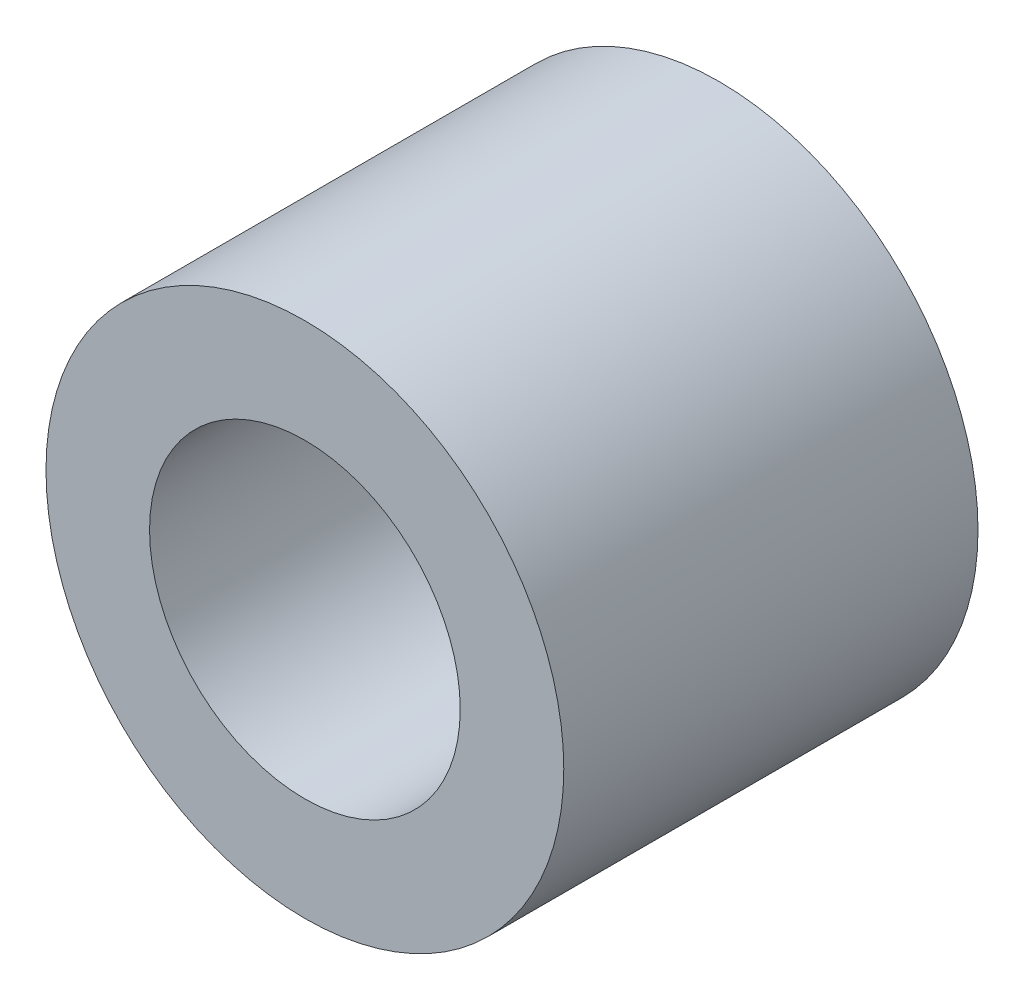
ISO-10303-21;
HEADER;
FILE_DESCRIPTION(('STEP AP214'),'2;1');
FILE_NAME('part.step','',(''),(''),'','','');
FILE_SCHEMA(('AUTOMOTIVE_DESIGN { 1 0 10303 214 1 1 1 1 }'));
ENDSEC;
DATA;
#1=APPLICATION_CONTEXT('core data for automotive mechanical design processes');
#2=APPLICATION_PROTOCOL_DEFINITION('international standard','automotive_design',2000,#1);
#3=PRODUCT_CONTEXT('',#1,'mechanical');
#4=PRODUCT('Part','Part','',(#3));
#5=PRODUCT_RELATED_PRODUCT_CATEGORY('part','',(#4));
#6=PRODUCT_DEFINITION_FORMATION('','',#4);
#7=PRODUCT_DEFINITION_CONTEXT('part definition',#1,'design');
#8=PRODUCT_DEFINITION('design','',#6,#7);
#9=PRODUCT_DEFINITION_SHAPE('','',#8);
#10=(LENGTH_UNIT() NAMED_UNIT(*) SI_UNIT(.MILLI.,.METRE.));
#11=(NAMED_UNIT(*) PLANE_ANGLE_UNIT() SI_UNIT($,.RADIAN.));
#12=(NAMED_UNIT(*) SI_UNIT($,.STERADIAN.) SOLID_ANGLE_UNIT());
#13=UNCERTAINTY_MEASURE_WITH_UNIT(LENGTH_MEASURE(1.E-05),#10,'distance_accuracy_value','');
#14=(GEOMETRIC_REPRESENTATION_CONTEXT(3) GLOBAL_UNCERTAINTY_ASSIGNED_CONTEXT((#13)) GLOBAL_UNIT_ASSIGNED_CONTEXT((#10,
#11,#12)) REPRESENTATION_CONTEXT('',''));
#15=CARTESIAN_POINT('',(0.,0.,0.));
#16=DIRECTION('',(0.,0.,1.));
#17=DIRECTION('',(1.,0.,0.));
#18=AXIS2_PLACEMENT_3D('',#15,#16,#17);
#19=CARTESIAN_POINT('',(0.,0.,8.));
#20=DIRECTION('',(0.,0.,-1.));
#21=DIRECTION('',(-1.,0.,0.));
#22=AXIS2_PLACEMENT_3D('',#19,#20,#21);
#23=CYLINDRICAL_SURFACE('',#22,3.);
#24=CARTESIAN_POINT('',(0.,0.,0.));
#25=DIRECTION('',(0.,0.,-1.));
#26=DIRECTION('',(-1.,0.,0.));
#27=AXIS2_PLACEMENT_3D('',#24,#25,#26);
#28=CIRCLE('',#27,3.);
#29=CARTESIAN_POINT('',(-3.,0.,0.));
#30=VERTEX_POINT('',#29);
#31=EDGE_CURVE('E27',#30,#30,#28,.T.);
#32=ORIENTED_EDGE('',*,*,#31,.T.);
#33=EDGE_LOOP('',(#32));
#34=FACE_BOUND('',#33,.T.);
#35=CARTESIAN_POINT('',(0.,0.,8.));
#36=DIRECTION('',(0.,0.,-1.));
#37=DIRECTION('',(-1.,0.,0.));
#38=AXIS2_PLACEMENT_3D('',#35,#36,#37);
#39=CIRCLE('',#38,3.);
#40=CARTESIAN_POINT('',(-3.,0.,8.));
#41=VERTEX_POINT('',#40);
#42=EDGE_CURVE('E18',#41,#41,#39,.T.);
#43=ORIENTED_EDGE('',*,*,#42,.F.);
#44=EDGE_LOOP('',(#43));
#45=FACE_BOUND('',#44,.T.);
#46=ADVANCED_FACE('F15',(#34,#45),#23,.F.);
#47=CARTESIAN_POINT('',(0.,0.,8.));
#48=DIRECTION('',(0.,0.,1.));
#49=DIRECTION('',(1.,0.,0.));
#50=AXIS2_PLACEMENT_3D('',#47,#48,#49);
#51=PLANE('',#50);
#52=ORIENTED_EDGE('',*,*,#42,.T.);
#53=EDGE_LOOP('',(#52));
#54=FACE_BOUND('',#53,.T.);
#55=CARTESIAN_POINT('',(0.,0.,8.));
#56=DIRECTION('',(0.,0.,-1.));
#57=DIRECTION('',(-1.,0.,0.));
#58=AXIS2_PLACEMENT_3D('',#55,#56,#57);
#59=CIRCLE('',#58,5.);
#60=CARTESIAN_POINT('',(-5.,0.,8.));
#61=VERTEX_POINT('',#60);
#62=EDGE_CURVE('E22',#61,#61,#59,.T.);
#63=ORIENTED_EDGE('',*,*,#62,.F.);
#64=EDGE_LOOP('',(#63));
#65=FACE_BOUND('',#64,.T.);
#66=ADVANCED_FACE('F35',(#54,#65),#51,.T.);
#67=CARTESIAN_POINT('',(0.,0.,0.));
#68=DIRECTION('',(0.,0.,1.));
#69=DIRECTION('',(1.,0.,0.));
#70=AXIS2_PLACEMENT_3D('',#67,#68,#69);
#71=PLANE('',#70);
#72=ORIENTED_EDGE('',*,*,#31,.F.);
#73=EDGE_LOOP('',(#72));
#74=FACE_BOUND('',#73,.T.);
#75=CARTESIAN_POINT('',(0.,0.,0.));
#76=DIRECTION('',(0.,0.,-1.));
#77=DIRECTION('',(-1.,0.,0.));
#78=AXIS2_PLACEMENT_3D('',#75,#76,#77);
#79=CIRCLE('',#78,5.);
#80=CARTESIAN_POINT('',(-5.,0.,0.));
#81=VERTEX_POINT('',#80);
#82=EDGE_CURVE('E10',#81,#81,#79,.F.);
#83=ORIENTED_EDGE('',*,*,#82,.F.);
#84=EDGE_LOOP('',(#83));
#85=FACE_BOUND('',#84,.T.);
#86=ADVANCED_FACE('F43',(#74,#85),#71,.F.);
#87=CARTESIAN_POINT('',(0.,0.,8.));
#88=DIRECTION('',(0.,0.,-1.));
#89=DIRECTION('',(-1.,0.,0.));
#90=AXIS2_PLACEMENT_3D('',#87,#88,#89);
#91=CYLINDRICAL_SURFACE('',#90,5.);
#92=ORIENTED_EDGE('',*,*,#82,.T.);
#93=EDGE_LOOP('',(#92));
#94=FACE_BOUND('',#93,.T.);
#95=ORIENTED_EDGE('',*,*,#62,.T.);
#96=EDGE_LOOP('',(#95));
#97=FACE_BOUND('',#96,.T.);
#98=ADVANCED_FACE('F44',(#94,#97),#91,.T.);
#99=CLOSED_SHELL('',(#46,#66,#86,#98));
#100=MANIFOLD_SOLID_BREP('B1',#99);
#101=ADVANCED_BREP_SHAPE_REPRESENTATION('',(#18,#100),#14);
#102=SHAPE_DEFINITION_REPRESENTATION(#9,#101);
ENDSEC;
END-ISO-10303-21;
